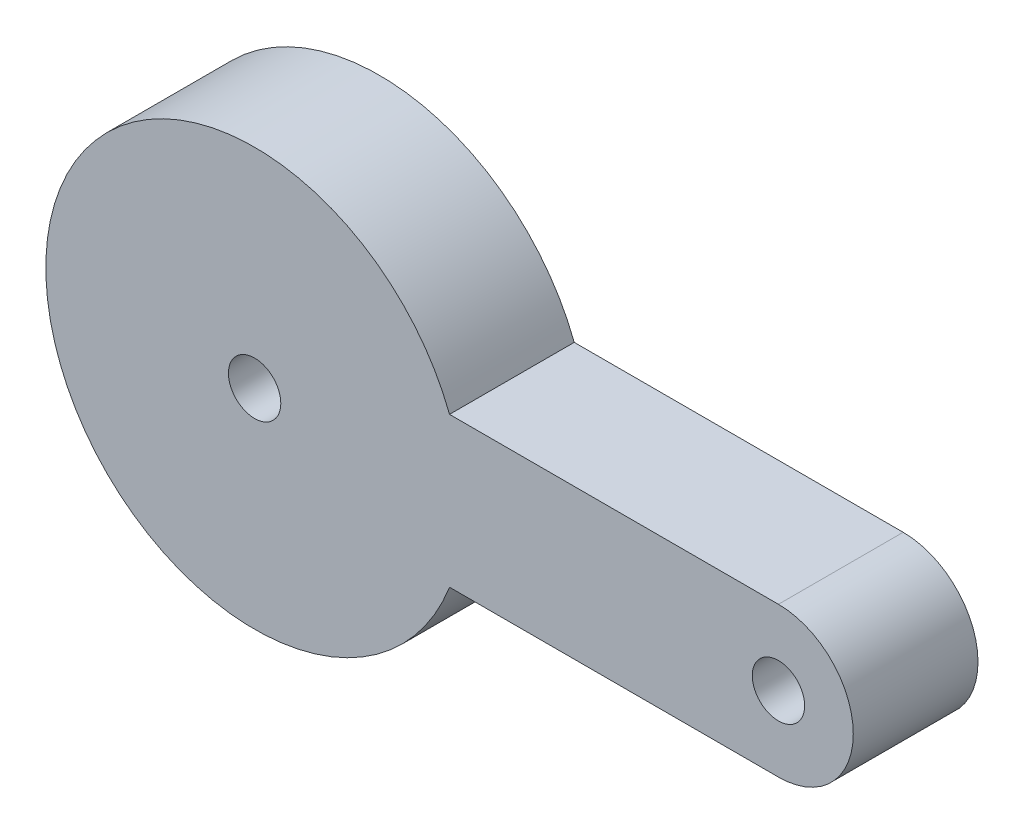
ISO-10303-21;
HEADER;
FILE_DESCRIPTION(('STEP AP214'),'2;1');
FILE_NAME('part.step','',(''),(''),'','','');
FILE_SCHEMA(('AUTOMOTIVE_DESIGN { 1 0 10303 214 1 1 1 1 }'));
ENDSEC;
DATA;
#1=APPLICATION_CONTEXT('core data for automotive mechanical design processes');
#2=APPLICATION_PROTOCOL_DEFINITION('international standard','automotive_design',2000,#1);
#3=PRODUCT_CONTEXT('',#1,'mechanical');
#4=PRODUCT('Part','Part','',(#3));
#5=PRODUCT_RELATED_PRODUCT_CATEGORY('part','',(#4));
#6=PRODUCT_DEFINITION_FORMATION('','',#4);
#7=PRODUCT_DEFINITION_CONTEXT('part definition',#1,'design');
#8=PRODUCT_DEFINITION('design','',#6,#7);
#9=PRODUCT_DEFINITION_SHAPE('','',#8);
#10=(LENGTH_UNIT() NAMED_UNIT(*) SI_UNIT(.MILLI.,.METRE.));
#11=(NAMED_UNIT(*) PLANE_ANGLE_UNIT() SI_UNIT($,.RADIAN.));
#12=(NAMED_UNIT(*) SI_UNIT($,.STERADIAN.) SOLID_ANGLE_UNIT());
#13=UNCERTAINTY_MEASURE_WITH_UNIT(LENGTH_MEASURE(1.E-05),#10,'distance_accuracy_value','');
#14=(GEOMETRIC_REPRESENTATION_CONTEXT(3) GLOBAL_UNCERTAINTY_ASSIGNED_CONTEXT((#13)) GLOBAL_UNIT_ASSIGNED_CONTEXT((#10,
#11,#12)) REPRESENTATION_CONTEXT('',''));
#15=CARTESIAN_POINT('',(0.,0.,0.));
#16=DIRECTION('',(0.,0.,1.));
#17=DIRECTION('',(1.,0.,0.));
#18=AXIS2_PLACEMENT_3D('',#15,#16,#17);
#19=CARTESIAN_POINT('',(35.,0.,8.33333333333333));
#20=DIRECTION('',(0.,0.,1.));
#21=DIRECTION('',(1.,0.,0.));
#22=AXIS2_PLACEMENT_3D('',#19,#20,#21);
#23=PLANE('',#22);
#24=CARTESIAN_POINT('',(0.,0.,8.33333333333333));
#25=DIRECTION('',(0.,0.,1.));
#26=DIRECTION('',(1.,0.,0.));
#27=AXIS2_PLACEMENT_3D('',#24,#25,#26);
#28=CIRCLE('',#27,1.75);
#29=CARTESIAN_POINT('',(1.75,0.,8.33333333333333));
#30=VERTEX_POINT('',#29);
#31=EDGE_CURVE('E112',#30,#30,#28,.T.);
#32=ORIENTED_EDGE('',*,*,#31,.F.);
#33=EDGE_LOOP('',(#32));
#34=FACE_BOUND('',#33,.T.);
#35=CARTESIAN_POINT('',(35.,0.,8.33333333333333));
#36=DIRECTION('',(0.,0.,1.));
#37=DIRECTION('',(1.,0.,0.));
#38=AXIS2_PLACEMENT_3D('',#35,#36,#37);
#39=CIRCLE('',#38,5.);
#40=CARTESIAN_POINT('',(35.,-5.,8.33333333333333));
#41=VERTEX_POINT('',#40);
#42=CARTESIAN_POINT('',(35.,5.,8.33333333333333));
#43=VERTEX_POINT('',#42);
#44=EDGE_CURVE('E92',#41,#43,#39,.T.);
#45=ORIENTED_EDGE('',*,*,#44,.T.);
#46=DIRECTION('',(-1.,0.,0.));
#47=VECTOR('',#46,1.);
#48=CARTESIAN_POINT('',(35.,5.,8.33333333333333));
#49=LINE('',#48,#47);
#50=CARTESIAN_POINT('',(13.0231524601381,5.,8.33333333333333));
#51=VERTEX_POINT('',#50);
#52=EDGE_CURVE('E87',#43,#51,#49,.T.);
#53=ORIENTED_EDGE('',*,*,#52,.T.);
#54=CARTESIAN_POINT('',(0.,0.,8.33333333333333));
#55=DIRECTION('',(0.,0.,1.));
#56=DIRECTION('',(1.,0.,0.));
#57=AXIS2_PLACEMENT_3D('',#54,#55,#56);
#58=CIRCLE('',#57,13.95);
#59=CARTESIAN_POINT('',(13.0231524601381,-5.00000000000001,8.33333333333333));
#60=VERTEX_POINT('',#59);
#61=EDGE_CURVE('E90',#51,#60,#58,.T.);
#62=ORIENTED_EDGE('',*,*,#61,.T.);
#63=DIRECTION('',(1.,0.,0.));
#64=VECTOR('',#63,1.);
#65=CARTESIAN_POINT('',(35.,-5.,8.33333333333333));
#66=LINE('',#65,#64);
#67=EDGE_CURVE('E57',#60,#41,#66,.T.);
#68=ORIENTED_EDGE('',*,*,#67,.T.);
#69=EDGE_LOOP('',(#45,#53,#62,#68));
#70=FACE_BOUND('',#69,.T.);
#71=CARTESIAN_POINT('',(35.,0.,8.33333333333333));
#72=DIRECTION('',(0.,0.,1.));
#73=DIRECTION('',(1.,0.,0.));
#74=AXIS2_PLACEMENT_3D('',#71,#72,#73);
#75=CIRCLE('',#74,1.75);
#76=CARTESIAN_POINT('',(36.75,0.,8.33333333333333));
#77=VERTEX_POINT('',#76);
#78=EDGE_CURVE('E134',#77,#77,#75,.T.);
#79=ORIENTED_EDGE('',*,*,#78,.F.);
#80=EDGE_LOOP('',(#79));
#81=FACE_BOUND('',#80,.T.);
#82=ADVANCED_FACE('F39',(#34,#70,#81),#23,.T.);
#83=CARTESIAN_POINT('',(35.,0.,0.));
#84=DIRECTION('',(0.,0.,1.));
#85=DIRECTION('',(1.,0.,0.));
#86=AXIS2_PLACEMENT_3D('',#83,#84,#85);
#87=PLANE('',#86);
#88=CARTESIAN_POINT('',(35.,0.,0.));
#89=DIRECTION('',(0.,0.,1.));
#90=DIRECTION('',(1.,0.,0.));
#91=AXIS2_PLACEMENT_3D('',#88,#89,#90);
#92=CIRCLE('',#91,5.);
#93=CARTESIAN_POINT('',(35.,-5.,0.));
#94=VERTEX_POINT('',#93);
#95=CARTESIAN_POINT('',(35.,5.,0.));
#96=VERTEX_POINT('',#95);
#97=EDGE_CURVE('E108',#94,#96,#92,.T.);
#98=ORIENTED_EDGE('',*,*,#97,.F.);
#99=DIRECTION('',(1.,0.,0.));
#100=VECTOR('',#99,1.);
#101=CARTESIAN_POINT('',(35.,-5.,0.));
#102=LINE('',#101,#100);
#103=CARTESIAN_POINT('',(13.0231524601381,-5.00000000000001,0.));
#104=VERTEX_POINT('',#103);
#105=EDGE_CURVE('E80',#104,#94,#102,.T.);
#106=ORIENTED_EDGE('',*,*,#105,.F.);
#107=CARTESIAN_POINT('',(0.,0.,0.));
#108=DIRECTION('',(0.,0.,1.));
#109=DIRECTION('',(1.,0.,0.));
#110=AXIS2_PLACEMENT_3D('',#107,#108,#109);
#111=CIRCLE('',#110,13.95);
#112=CARTESIAN_POINT('',(13.0231524601381,5.,0.));
#113=VERTEX_POINT('',#112);
#114=EDGE_CURVE('E74',#113,#104,#111,.T.);
#115=ORIENTED_EDGE('',*,*,#114,.F.);
#116=DIRECTION('',(-1.,0.,0.));
#117=VECTOR('',#116,1.);
#118=CARTESIAN_POINT('',(35.,5.,0.));
#119=LINE('',#118,#117);
#120=EDGE_CURVE('E97',#96,#113,#119,.T.);
#121=ORIENTED_EDGE('',*,*,#120,.F.);
#122=EDGE_LOOP('',(#98,#106,#115,#121));
#123=FACE_BOUND('',#122,.T.);
#124=CARTESIAN_POINT('',(0.,0.,0.));
#125=DIRECTION('',(0.,0.,1.));
#126=DIRECTION('',(1.,0.,0.));
#127=AXIS2_PLACEMENT_3D('',#124,#125,#126);
#128=CIRCLE('',#127,1.75);
#129=CARTESIAN_POINT('',(1.75,0.,0.));
#130=VERTEX_POINT('',#129);
#131=EDGE_CURVE('E130',#130,#130,#128,.T.);
#132=ORIENTED_EDGE('',*,*,#131,.T.);
#133=EDGE_LOOP('',(#132));
#134=FACE_BOUND('',#133,.T.);
#135=CARTESIAN_POINT('',(35.,0.,0.));
#136=DIRECTION('',(0.,0.,1.));
#137=DIRECTION('',(1.,0.,0.));
#138=AXIS2_PLACEMENT_3D('',#135,#136,#137);
#139=CIRCLE('',#138,1.75);
#140=CARTESIAN_POINT('',(36.75,0.,0.));
#141=VERTEX_POINT('',#140);
#142=EDGE_CURVE('E138',#141,#141,#139,.T.);
#143=ORIENTED_EDGE('',*,*,#142,.T.);
#144=EDGE_LOOP('',(#143));
#145=FACE_BOUND('',#144,.T.);
#146=ADVANCED_FACE('F125',(#123,#134,#145),#87,.F.);
#147=CARTESIAN_POINT('',(35.,0.,8.33333333333333));
#148=DIRECTION('',(0.,0.,-1.));
#149=DIRECTION('',(-1.,0.,0.));
#150=AXIS2_PLACEMENT_3D('',#147,#148,#149);
#151=CYLINDRICAL_SURFACE('',#150,5.);
#152=ORIENTED_EDGE('',*,*,#97,.T.);
#153=DIRECTION('',(0.,0.,-1.));
#154=VECTOR('',#153,1.);
#155=CARTESIAN_POINT('',(35.,5.,8.33333333333333));
#156=LINE('',#155,#154);
#157=EDGE_CURVE('E11',#43,#96,#156,.T.);
#158=ORIENTED_EDGE('',*,*,#157,.F.);
#159=ORIENTED_EDGE('',*,*,#44,.F.);
#160=DIRECTION('',(0.,0.,-1.));
#161=VECTOR('',#160,1.);
#162=CARTESIAN_POINT('',(35.,-5.,8.33333333333333));
#163=LINE('',#162,#161);
#164=EDGE_CURVE('E104',#41,#94,#163,.T.);
#165=ORIENTED_EDGE('',*,*,#164,.T.);
#166=EDGE_LOOP('',(#152,#158,#159,#165));
#167=FACE_BOUND('',#166,.T.);
#168=ADVANCED_FACE('F41',(#167),#151,.T.);
#169=CARTESIAN_POINT('',(35.,5.,8.33333333333333));
#170=DIRECTION('',(0.,-1.,0.));
#171=DIRECTION('',(1.,0.,0.));
#172=AXIS2_PLACEMENT_3D('',#169,#170,#171);
#173=PLANE('',#172);
#174=ORIENTED_EDGE('',*,*,#120,.T.);
#175=DIRECTION('',(0.,0.,-1.));
#176=VECTOR('',#175,1.);
#177=CARTESIAN_POINT('',(13.0231524601381,5.,8.33333333333333));
#178=LINE('',#177,#176);
#179=EDGE_CURVE('E49',#51,#113,#178,.T.);
#180=ORIENTED_EDGE('',*,*,#179,.F.);
#181=ORIENTED_EDGE('',*,*,#52,.F.);
#182=ORIENTED_EDGE('',*,*,#157,.T.);
#183=EDGE_LOOP('',(#174,#180,#181,#182));
#184=FACE_BOUND('',#183,.T.);
#185=ADVANCED_FACE('F96',(#184),#173,.F.);
#186=CARTESIAN_POINT('',(0.,0.,8.33333333333333));
#187=DIRECTION('',(0.,0.,-1.));
#188=DIRECTION('',(-1.,0.,0.));
#189=AXIS2_PLACEMENT_3D('',#186,#187,#188);
#190=CYLINDRICAL_SURFACE('',#189,13.95);
#191=ORIENTED_EDGE('',*,*,#114,.T.);
#192=DIRECTION('',(0.,0.,-1.));
#193=VECTOR('',#192,1.);
#194=CARTESIAN_POINT('',(13.0231524601381,-5.00000000000001,8.33333333333333));
#195=LINE('',#194,#193);
#196=EDGE_CURVE('E99',#60,#104,#195,.T.);
#197=ORIENTED_EDGE('',*,*,#196,.F.);
#198=ORIENTED_EDGE('',*,*,#61,.F.);
#199=ORIENTED_EDGE('',*,*,#179,.T.);
#200=EDGE_LOOP('',(#191,#197,#198,#199));
#201=FACE_BOUND('',#200,.T.);
#202=ADVANCED_FACE('F100',(#201),#190,.T.);
#203=CARTESIAN_POINT('',(35.,-5.,8.33333333333333));
#204=DIRECTION('',(0.,1.,0.));
#205=DIRECTION('',(-1.,0.,0.));
#206=AXIS2_PLACEMENT_3D('',#203,#204,#205);
#207=PLANE('',#206);
#208=ORIENTED_EDGE('',*,*,#105,.T.);
#209=ORIENTED_EDGE('',*,*,#164,.F.);
#210=ORIENTED_EDGE('',*,*,#67,.F.);
#211=ORIENTED_EDGE('',*,*,#196,.T.);
#212=EDGE_LOOP('',(#208,#209,#210,#211));
#213=FACE_BOUND('',#212,.T.);
#214=ADVANCED_FACE('F122',(#213),#207,.F.);
#215=CARTESIAN_POINT('',(0.,0.,8.33333333333333));
#216=DIRECTION('',(0.,0.,-1.));
#217=DIRECTION('',(-1.,0.,0.));
#218=AXIS2_PLACEMENT_3D('',#215,#216,#217);
#219=CYLINDRICAL_SURFACE('',#218,1.75);
#220=ORIENTED_EDGE('',*,*,#31,.T.);
#221=EDGE_LOOP('',(#220));
#222=FACE_BOUND('',#221,.T.);
#223=ORIENTED_EDGE('',*,*,#131,.F.);
#224=EDGE_LOOP('',(#223));
#225=FACE_BOUND('',#224,.T.);
#226=ADVANCED_FACE('F157',(#222,#225),#219,.F.);
#227=CARTESIAN_POINT('',(35.,0.,8.33333333333333));
#228=DIRECTION('',(0.,0.,-1.));
#229=DIRECTION('',(-1.,0.,0.));
#230=AXIS2_PLACEMENT_3D('',#227,#228,#229);
#231=CYLINDRICAL_SURFACE('',#230,1.75);
#232=ORIENTED_EDGE('',*,*,#78,.T.);
#233=EDGE_LOOP('',(#232));
#234=FACE_BOUND('',#233,.T.);
#235=ORIENTED_EDGE('',*,*,#142,.F.);
#236=EDGE_LOOP('',(#235));
#237=FACE_BOUND('',#236,.T.);
#238=ADVANCED_FACE('F146',(#234,#237),#231,.F.);
#239=CLOSED_SHELL('',(#82,#146,#168,#185,#202,#214,#226,#238));
#240=MANIFOLD_SOLID_BREP('B2',#239);
#241=ADVANCED_BREP_SHAPE_REPRESENTATION('',(#18,#240),#14);
#242=SHAPE_DEFINITION_REPRESENTATION(#9,#241);
ENDSEC;
END-ISO-10303-21;
